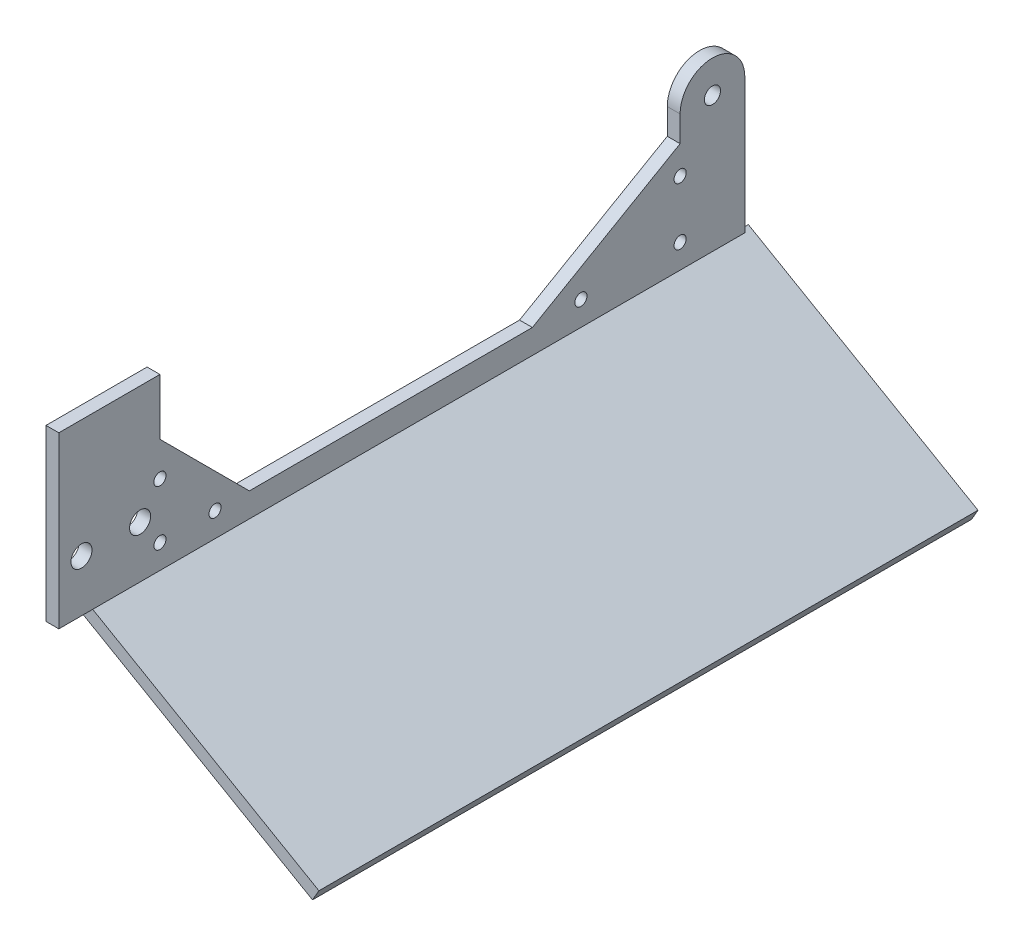
ISO-10303-21;
HEADER;
FILE_DESCRIPTION(('STEP AP214'),'2;1');
FILE_NAME('part.step','',(''),(''),'','','');
FILE_SCHEMA(('AUTOMOTIVE_DESIGN { 1 0 10303 214 1 1 1 1 }'));
ENDSEC;
DATA;
#1=APPLICATION_CONTEXT('core data for automotive mechanical design processes');
#2=APPLICATION_PROTOCOL_DEFINITION('international standard','automotive_design',2000,#1);
#3=PRODUCT_CONTEXT('',#1,'mechanical');
#4=PRODUCT('Part','Part','',(#3));
#5=PRODUCT_RELATED_PRODUCT_CATEGORY('part','',(#4));
#6=PRODUCT_DEFINITION_FORMATION('','',#4);
#7=PRODUCT_DEFINITION_CONTEXT('part definition',#1,'design');
#8=PRODUCT_DEFINITION('design','',#6,#7);
#9=PRODUCT_DEFINITION_SHAPE('','',#8);
#10=(LENGTH_UNIT() NAMED_UNIT(*) SI_UNIT(.MILLI.,.METRE.));
#11=(NAMED_UNIT(*) PLANE_ANGLE_UNIT() SI_UNIT($,.RADIAN.));
#12=(NAMED_UNIT(*) SI_UNIT($,.STERADIAN.) SOLID_ANGLE_UNIT());
#13=UNCERTAINTY_MEASURE_WITH_UNIT(LENGTH_MEASURE(1.E-05),#10,'distance_accuracy_value','');
#14=(GEOMETRIC_REPRESENTATION_CONTEXT(3) GLOBAL_UNCERTAINTY_ASSIGNED_CONTEXT((#13)) GLOBAL_UNIT_ASSIGNED_CONTEXT((#10,
#11,#12)) REPRESENTATION_CONTEXT('',''));
#15=CARTESIAN_POINT('',(0.,0.,0.));
#16=DIRECTION('',(0.,0.,1.));
#17=DIRECTION('',(1.,0.,0.));
#18=AXIS2_PLACEMENT_3D('',#15,#16,#17);
#19=CARTESIAN_POINT('',(3.175,36.4648077538263,-152.534918300919));
#20=DIRECTION('',(-1.,0.,0.));
#21=DIRECTION('',(0.,0.,1.));
#22=AXIS2_PLACEMENT_3D('',#19,#20,#21);
#23=PLANE('',#22);
#24=DIRECTION('',(0.,0.,1.));
#25=VECTOR('',#24,1.);
#26=CARTESIAN_POINT('',(3.175,8.99999999999999,-38.));
#27=LINE('',#26,#25);
#28=CARTESIAN_POINT('',(3.175,9.,-108.));
#29=VERTEX_POINT('',#28);
#30=CARTESIAN_POINT('',(3.175,8.99999999999999,-38.));
#31=VERTEX_POINT('',#30);
#32=EDGE_CURVE('E173',#29,#31,#27,.T.);
#33=ORIENTED_EDGE('',*,*,#32,.T.);
#34=DIRECTION('',(0.,0.707106781186549,0.707106781186546));
#35=VECTOR('',#34,1.);
#36=CARTESIAN_POINT('',(3.175,31.1150816990814,-15.8849183009187));
#37=LINE('',#36,#35);
#38=CARTESIAN_POINT('',(3.175,31.1150816990814,-15.8849183009187));
#39=VERTEX_POINT('',#38);
#40=EDGE_CURVE('E111',#31,#39,#37,.T.);
#41=ORIENTED_EDGE('',*,*,#40,.T.);
#42=DIRECTION('',(0.,1.,0.));
#43=VECTOR('',#42,1.);
#44=CARTESIAN_POINT('',(3.175,45.,-15.8849183009187));
#45=LINE('',#44,#43);
#46=CARTESIAN_POINT('',(3.175,45.,-15.8849183009187));
#47=VERTEX_POINT('',#46);
#48=EDGE_CURVE('E194',#39,#47,#45,.T.);
#49=ORIENTED_EDGE('',*,*,#48,.T.);
#50=DIRECTION('',(0.,0.,1.));
#51=VECTOR('',#50,1.);
#52=CARTESIAN_POINT('',(3.175,45.,9.11508169908136));
#53=LINE('',#52,#51);
#54=CARTESIAN_POINT('',(3.175,45.,9.11508169908136));
#55=VERTEX_POINT('',#54);
#56=EDGE_CURVE('E213',#47,#55,#53,.T.);
#57=ORIENTED_EDGE('',*,*,#56,.T.);
#58=DIRECTION('',(0.,-1.,0.));
#59=VECTOR('',#58,1.);
#60=CARTESIAN_POINT('',(3.175,45.,9.11508169908136));
#61=LINE('',#60,#59);
#62=CARTESIAN_POINT('',(3.175,2.99999999999999,9.11508169908136));
#63=VERTEX_POINT('',#62);
#64=EDGE_CURVE('E210',#55,#63,#61,.T.);
#65=ORIENTED_EDGE('',*,*,#64,.T.);
#66=DIRECTION('',(0.,0.,-1.));
#67=VECTOR('',#66,1.);
#68=CARTESIAN_POINT('',(3.175,2.99999999999999,9.11508169908136));
#69=LINE('',#68,#67);
#70=CARTESIAN_POINT('',(3.175,3.,-160.534918300919));
#71=VERTEX_POINT('',#70);
#72=EDGE_CURVE('E212',#63,#71,#69,.T.);
#73=ORIENTED_EDGE('',*,*,#72,.T.);
#74=DIRECTION('',(0.,1.,0.));
#75=VECTOR('',#74,1.);
#76=CARTESIAN_POINT('',(3.175,3.,-160.534918300919));
#77=LINE('',#76,#75);
#78=CARTESIAN_POINT('',(3.175,36.4648077538263,-160.534918300919));
#79=VERTEX_POINT('',#78);
#80=EDGE_CURVE('E136',#71,#79,#77,.T.);
#81=ORIENTED_EDGE('',*,*,#80,.T.);
#82=CARTESIAN_POINT('',(3.175,36.4648077538263,-152.534918300919));
#83=DIRECTION('',(1.,0.,0.));
#84=DIRECTION('',(0.,0.,1.));
#85=AXIS2_PLACEMENT_3D('',#82,#83,#84);
#86=CIRCLE('',#85,7.99999999999999);
#87=CARTESIAN_POINT('',(3.175,36.4648077538263,-144.534918300919));
#88=VERTEX_POINT('',#87);
#89=EDGE_CURVE('E130',#79,#88,#86,.T.);
#90=ORIENTED_EDGE('',*,*,#89,.T.);
#91=DIRECTION('',(0.,-1.,0.));
#92=VECTOR('',#91,1.);
#93=CARTESIAN_POINT('',(3.175,36.4648077538263,-144.534918300919));
#94=LINE('',#93,#92);
#95=CARTESIAN_POINT('',(3.175,30.0934449158564,-144.534918300919));
#96=VERTEX_POINT('',#95);
#97=EDGE_CURVE('E134',#88,#96,#94,.T.);
#98=ORIENTED_EDGE('',*,*,#97,.T.);
#99=DIRECTION('',(0.,-0.499999999999998,0.86602540378444));
#100=VECTOR('',#99,1.);
#101=CARTESIAN_POINT('',(3.175,30.0934449158564,-144.534918300919));
#102=LINE('',#101,#100);
#103=EDGE_CURVE('E62',#96,#29,#102,.T.);
#104=ORIENTED_EDGE('',*,*,#103,.T.);
#105=EDGE_LOOP('',(#33,#41,#49,#57,#65,#73,#81,#90,#98,#104));
#106=FACE_BOUND('',#105,.T.);
#107=CARTESIAN_POINT('',(3.175,36.4648077538263,-152.534918300919));
#108=DIRECTION('',(1.,0.,0.));
#109=DIRECTION('',(0.,0.,-1.));
#110=AXIS2_PLACEMENT_3D('',#107,#108,#109);
#111=CIRCLE('',#110,2.);
#112=CARTESIAN_POINT('',(3.175,36.4648077538263,-154.534918300919));
#113=VERTEX_POINT('',#112);
#114=EDGE_CURVE('E158',#113,#113,#111,.T.);
#115=ORIENTED_EDGE('',*,*,#114,.F.);
#116=EDGE_LOOP('',(#115));
#117=FACE_BOUND('',#116,.T.);
#118=CARTESIAN_POINT('',(3.175,15.814900162421,3.51508169908136));
#119=DIRECTION('',(1.,0.,0.));
#120=DIRECTION('',(0.,0.,-1.));
#121=AXIS2_PLACEMENT_3D('',#118,#119,#120);
#122=CIRCLE('',#121,2.6);
#123=CARTESIAN_POINT('',(3.175,15.814900162421,0.915081699081354));
#124=VERTEX_POINT('',#123);
#125=EDGE_CURVE('E224',#124,#124,#122,.T.);
#126=ORIENTED_EDGE('',*,*,#125,.F.);
#127=EDGE_LOOP('',(#126));
#128=FACE_BOUND('',#127,.T.);
#129=CARTESIAN_POINT('',(3.175,15.814900162421,-10.9849183009186));
#130=DIRECTION('',(1.,0.,0.));
#131=DIRECTION('',(0.,0.,-1.));
#132=AXIS2_PLACEMENT_3D('',#129,#130,#131);
#133=CIRCLE('',#132,2.6);
#134=CARTESIAN_POINT('',(3.175,15.814900162421,-13.5849183009186));
#135=VERTEX_POINT('',#134);
#136=EDGE_CURVE('E230',#135,#135,#133,.T.);
#137=ORIENTED_EDGE('',*,*,#136,.F.);
#138=EDGE_LOOP('',(#137));
#139=FACE_BOUND('',#138,.T.);
#140=CARTESIAN_POINT('',(3.175,22.6298003248428,-15.8849183009187));
#141=DIRECTION('',(1.,0.,0.));
#142=DIRECTION('',(0.,0.,-1.));
#143=AXIS2_PLACEMENT_3D('',#140,#141,#142);
#144=CIRCLE('',#143,1.50000000000008);
#145=CARTESIAN_POINT('',(3.175,22.6298003248428,-17.3849183009188));
#146=VERTEX_POINT('',#145);
#147=EDGE_CURVE('E236',#146,#146,#144,.T.);
#148=ORIENTED_EDGE('',*,*,#147,.F.);
#149=EDGE_LOOP('',(#148));
#150=FACE_BOUND('',#149,.T.);
#151=CARTESIAN_POINT('',(3.175,8.99999999999999,-120.));
#152=DIRECTION('',(1.,0.,0.));
#153=DIRECTION('',(0.,0.,-1.));
#154=AXIS2_PLACEMENT_3D('',#151,#152,#153);
#155=CIRCLE('',#154,1.49999999999996);
#156=CARTESIAN_POINT('',(3.175,8.99999999999999,-121.5));
#157=VERTEX_POINT('',#156);
#158=EDGE_CURVE('E242',#157,#157,#155,.T.);
#159=ORIENTED_EDGE('',*,*,#158,.F.);
#160=EDGE_LOOP('',(#159));
#161=FACE_BOUND('',#160,.T.);
#162=CARTESIAN_POINT('',(3.175,8.99999999999999,-29.5147186257614));
#163=DIRECTION('',(1.,0.,0.));
#164=DIRECTION('',(0.,0.,-1.));
#165=AXIS2_PLACEMENT_3D('',#162,#163,#164);
#166=CIRCLE('',#165,1.50000000000002);
#167=CARTESIAN_POINT('',(3.175,8.99999999999999,-31.0147186257615));
#168=VERTEX_POINT('',#167);
#169=EDGE_CURVE('E248',#168,#168,#166,.T.);
#170=ORIENTED_EDGE('',*,*,#169,.F.);
#171=EDGE_LOOP('',(#170));
#172=FACE_BOUND('',#171,.T.);
#173=CARTESIAN_POINT('',(3.175,23.1652416855809,-144.534918300919));
#174=DIRECTION('',(1.,0.,0.));
#175=DIRECTION('',(0.,0.,-1.));
#176=AXIS2_PLACEMENT_3D('',#173,#174,#175);
#177=CIRCLE('',#176,1.50000000000003);
#178=CARTESIAN_POINT('',(3.175,23.1652416855809,-146.034918300919));
#179=VERTEX_POINT('',#178);
#180=EDGE_CURVE('E254',#179,#179,#177,.T.);
#181=ORIENTED_EDGE('',*,*,#180,.F.);
#182=EDGE_LOOP('',(#181));
#183=FACE_BOUND('',#182,.T.);
#184=CARTESIAN_POINT('',(3.175,9.,-144.534918300919));
#185=DIRECTION('',(1.,0.,0.));
#186=DIRECTION('',(0.,0.,-1.));
#187=AXIS2_PLACEMENT_3D('',#184,#185,#186);
#188=CIRCLE('',#187,1.5);
#189=CARTESIAN_POINT('',(3.175,9.,-146.034918300919));
#190=VERTEX_POINT('',#189);
#191=EDGE_CURVE('E260',#190,#190,#188,.T.);
#192=ORIENTED_EDGE('',*,*,#191,.F.);
#193=EDGE_LOOP('',(#192));
#194=FACE_BOUND('',#193,.T.);
#195=CARTESIAN_POINT('',(3.175,8.99999999999999,-15.8849183009187));
#196=DIRECTION('',(1.,0.,0.));
#197=DIRECTION('',(0.,0.,-1.));
#198=AXIS2_PLACEMENT_3D('',#195,#196,#197);
#199=CIRCLE('',#198,1.5);
#200=CARTESIAN_POINT('',(3.175,8.99999999999999,-17.3849183009187));
#201=VERTEX_POINT('',#200);
#202=EDGE_CURVE('E266',#201,#201,#199,.T.);
#203=ORIENTED_EDGE('',*,*,#202,.F.);
#204=EDGE_LOOP('',(#203));
#205=FACE_BOUND('',#204,.T.);
#206=ADVANCED_FACE('F45',(#106,#117,#128,#139,#150,#161,#172,#183,#194,#205),#23,.F.);
#207=CARTESIAN_POINT('',(0.,36.4648077538263,-152.534918300919));
#208=DIRECTION('',(-1.,0.,0.));
#209=DIRECTION('',(0.,0.,1.));
#210=AXIS2_PLACEMENT_3D('',#207,#208,#209);
#211=PLANE('',#210);
#212=CARTESIAN_POINT('',(0.,9.,-144.534918300919));
#213=DIRECTION('',(1.,0.,0.));
#214=DIRECTION('',(0.,0.,-1.));
#215=AXIS2_PLACEMENT_3D('',#212,#213,#214);
#216=CIRCLE('',#215,1.5);
#217=CARTESIAN_POINT('',(0.,9.,-146.034918300919));
#218=VERTEX_POINT('',#217);
#219=EDGE_CURVE('E263',#218,#218,#216,.T.);
#220=ORIENTED_EDGE('',*,*,#219,.T.);
#221=EDGE_LOOP('',(#220));
#222=FACE_BOUND('',#221,.T.);
#223=CARTESIAN_POINT('',(0.,8.99999999999999,-29.5147186257614));
#224=DIRECTION('',(1.,0.,0.));
#225=DIRECTION('',(0.,0.,-1.));
#226=AXIS2_PLACEMENT_3D('',#223,#224,#225);
#227=CIRCLE('',#226,1.50000000000002);
#228=CARTESIAN_POINT('',(0.,8.99999999999999,-31.0147186257615));
#229=VERTEX_POINT('',#228);
#230=EDGE_CURVE('E251',#229,#229,#227,.T.);
#231=ORIENTED_EDGE('',*,*,#230,.T.);
#232=EDGE_LOOP('',(#231));
#233=FACE_BOUND('',#232,.T.);
#234=CARTESIAN_POINT('',(0.,22.6298003248428,-15.8849183009187));
#235=DIRECTION('',(1.,0.,0.));
#236=DIRECTION('',(0.,0.,-1.));
#237=AXIS2_PLACEMENT_3D('',#234,#235,#236);
#238=CIRCLE('',#237,1.50000000000008);
#239=CARTESIAN_POINT('',(0.,22.6298003248428,-17.3849183009188));
#240=VERTEX_POINT('',#239);
#241=EDGE_CURVE('E239',#240,#240,#238,.T.);
#242=ORIENTED_EDGE('',*,*,#241,.T.);
#243=EDGE_LOOP('',(#242));
#244=FACE_BOUND('',#243,.T.);
#245=CARTESIAN_POINT('',(0.,15.814900162421,3.51508169908136));
#246=DIRECTION('',(1.,0.,0.));
#247=DIRECTION('',(0.,0.,-1.));
#248=AXIS2_PLACEMENT_3D('',#245,#246,#247);
#249=CIRCLE('',#248,2.6);
#250=CARTESIAN_POINT('',(0.,15.814900162421,0.915081699081354));
#251=VERTEX_POINT('',#250);
#252=EDGE_CURVE('E227',#251,#251,#249,.T.);
#253=ORIENTED_EDGE('',*,*,#252,.T.);
#254=EDGE_LOOP('',(#253));
#255=FACE_BOUND('',#254,.T.);
#256=DIRECTION('',(0.,0.,1.));
#257=VECTOR('',#256,1.);
#258=CARTESIAN_POINT('',(0.,8.99999999999999,-38.));
#259=LINE('',#258,#257);
#260=CARTESIAN_POINT('',(0.,9.,-108.));
#261=VERTEX_POINT('',#260);
#262=CARTESIAN_POINT('',(0.,8.99999999999999,-38.));
#263=VERTEX_POINT('',#262);
#264=EDGE_CURVE('E154',#261,#263,#259,.T.);
#265=ORIENTED_EDGE('',*,*,#264,.F.);
#266=DIRECTION('',(0.,-0.499999999999998,0.86602540378444));
#267=VECTOR('',#266,1.);
#268=CARTESIAN_POINT('',(0.,30.0934449158564,-144.534918300919));
#269=LINE('',#268,#267);
#270=CARTESIAN_POINT('',(0.,30.0934449158564,-144.534918300919));
#271=VERTEX_POINT('',#270);
#272=EDGE_CURVE('E103',#271,#261,#269,.T.);
#273=ORIENTED_EDGE('',*,*,#272,.F.);
#274=DIRECTION('',(0.,-1.,0.));
#275=VECTOR('',#274,1.);
#276=CARTESIAN_POINT('',(0.,36.4648077538263,-144.534918300919));
#277=LINE('',#276,#275);
#278=CARTESIAN_POINT('',(0.,36.4648077538263,-144.534918300919));
#279=VERTEX_POINT('',#278);
#280=EDGE_CURVE('E97',#279,#271,#277,.T.);
#281=ORIENTED_EDGE('',*,*,#280,.F.);
#282=CARTESIAN_POINT('',(0.,36.4648077538263,-152.534918300919));
#283=DIRECTION('',(1.,0.,0.));
#284=DIRECTION('',(0.,0.,1.));
#285=AXIS2_PLACEMENT_3D('',#282,#283,#284);
#286=CIRCLE('',#285,7.99999999999999);
#287=CARTESIAN_POINT('',(0.,36.4648077538263,-160.534918300919));
#288=VERTEX_POINT('',#287);
#289=EDGE_CURVE('E144',#288,#279,#286,.T.);
#290=ORIENTED_EDGE('',*,*,#289,.F.);
#291=DIRECTION('',(0.,1.,0.));
#292=VECTOR('',#291,1.);
#293=CARTESIAN_POINT('',(0.,3.,-160.534918300919));
#294=LINE('',#293,#292);
#295=CARTESIAN_POINT('',(0.,3.,-160.534918300919));
#296=VERTEX_POINT('',#295);
#297=EDGE_CURVE('E168',#296,#288,#294,.T.);
#298=ORIENTED_EDGE('',*,*,#297,.F.);
#299=DIRECTION('',(0.,0.,-1.));
#300=VECTOR('',#299,1.);
#301=CARTESIAN_POINT('',(0.,2.99999999999999,9.11508169908136));
#302=LINE('',#301,#300);
#303=CARTESIAN_POINT('',(0.,2.99999999999999,9.11508169908136));
#304=VERTEX_POINT('',#303);
#305=EDGE_CURVE('E166',#304,#296,#302,.T.);
#306=ORIENTED_EDGE('',*,*,#305,.F.);
#307=DIRECTION('',(0.,-1.,0.));
#308=VECTOR('',#307,1.);
#309=CARTESIAN_POINT('',(0.,45.,9.11508169908136));
#310=LINE('',#309,#308);
#311=CARTESIAN_POINT('',(0.,45.,9.11508169908136));
#312=VERTEX_POINT('',#311);
#313=EDGE_CURVE('E164',#312,#304,#310,.T.);
#314=ORIENTED_EDGE('',*,*,#313,.F.);
#315=DIRECTION('',(0.,0.,1.));
#316=VECTOR('',#315,1.);
#317=CARTESIAN_POINT('',(0.,45.,9.11508169908136));
#318=LINE('',#317,#316);
#319=CARTESIAN_POINT('',(0.,45.,-15.8849183009187));
#320=VERTEX_POINT('',#319);
#321=EDGE_CURVE('E162',#320,#312,#318,.T.);
#322=ORIENTED_EDGE('',*,*,#321,.F.);
#323=DIRECTION('',(0.,1.,0.));
#324=VECTOR('',#323,1.);
#325=CARTESIAN_POINT('',(0.,45.,-15.8849183009187));
#326=LINE('',#325,#324);
#327=CARTESIAN_POINT('',(0.,31.1150816990814,-15.8849183009187));
#328=VERTEX_POINT('',#327);
#329=EDGE_CURVE('E160',#328,#320,#326,.T.);
#330=ORIENTED_EDGE('',*,*,#329,.F.);
#331=DIRECTION('',(0.,0.707106781186549,0.707106781186546));
#332=VECTOR('',#331,1.);
#333=CARTESIAN_POINT('',(0.,31.1150816990814,-15.8849183009187));
#334=LINE('',#333,#332);
#335=EDGE_CURVE('E157',#263,#328,#334,.T.);
#336=ORIENTED_EDGE('',*,*,#335,.F.);
#337=EDGE_LOOP('',(#265,#273,#281,#290,#298,#306,#314,#322,#330,#336));
#338=FACE_BOUND('',#337,.T.);
#339=CARTESIAN_POINT('',(0.,36.4648077538263,-152.534918300919));
#340=DIRECTION('',(1.,0.,0.));
#341=DIRECTION('',(0.,0.,-1.));
#342=AXIS2_PLACEMENT_3D('',#339,#340,#341);
#343=CIRCLE('',#342,2.);
#344=CARTESIAN_POINT('',(0.,36.4648077538263,-154.534918300919));
#345=VERTEX_POINT('',#344);
#346=EDGE_CURVE('E221',#345,#345,#343,.T.);
#347=ORIENTED_EDGE('',*,*,#346,.T.);
#348=EDGE_LOOP('',(#347));
#349=FACE_BOUND('',#348,.T.);
#350=CARTESIAN_POINT('',(0.,15.814900162421,-10.9849183009186));
#351=DIRECTION('',(1.,0.,0.));
#352=DIRECTION('',(0.,0.,-1.));
#353=AXIS2_PLACEMENT_3D('',#350,#351,#352);
#354=CIRCLE('',#353,2.6);
#355=CARTESIAN_POINT('',(0.,15.814900162421,-13.5849183009186));
#356=VERTEX_POINT('',#355);
#357=EDGE_CURVE('E233',#356,#356,#354,.T.);
#358=ORIENTED_EDGE('',*,*,#357,.T.);
#359=EDGE_LOOP('',(#358));
#360=FACE_BOUND('',#359,.T.);
#361=CARTESIAN_POINT('',(0.,8.99999999999999,-120.));
#362=DIRECTION('',(1.,0.,0.));
#363=DIRECTION('',(0.,0.,-1.));
#364=AXIS2_PLACEMENT_3D('',#361,#362,#363);
#365=CIRCLE('',#364,1.49999999999996);
#366=CARTESIAN_POINT('',(0.,8.99999999999999,-121.5));
#367=VERTEX_POINT('',#366);
#368=EDGE_CURVE('E245',#367,#367,#365,.T.);
#369=ORIENTED_EDGE('',*,*,#368,.T.);
#370=EDGE_LOOP('',(#369));
#371=FACE_BOUND('',#370,.T.);
#372=CARTESIAN_POINT('',(0.,23.1652416855809,-144.534918300919));
#373=DIRECTION('',(1.,0.,0.));
#374=DIRECTION('',(0.,0.,-1.));
#375=AXIS2_PLACEMENT_3D('',#372,#373,#374);
#376=CIRCLE('',#375,1.50000000000003);
#377=CARTESIAN_POINT('',(0.,23.1652416855809,-146.034918300919));
#378=VERTEX_POINT('',#377);
#379=EDGE_CURVE('E257',#378,#378,#376,.T.);
#380=ORIENTED_EDGE('',*,*,#379,.T.);
#381=EDGE_LOOP('',(#380));
#382=FACE_BOUND('',#381,.T.);
#383=CARTESIAN_POINT('',(0.,8.99999999999999,-15.8849183009187));
#384=DIRECTION('',(1.,0.,0.));
#385=DIRECTION('',(0.,0.,-1.));
#386=AXIS2_PLACEMENT_3D('',#383,#384,#385);
#387=CIRCLE('',#386,1.5);
#388=CARTESIAN_POINT('',(0.,8.99999999999999,-17.3849183009187));
#389=VERTEX_POINT('',#388);
#390=EDGE_CURVE('E269',#389,#389,#387,.T.);
#391=ORIENTED_EDGE('',*,*,#390,.T.);
#392=EDGE_LOOP('',(#391));
#393=FACE_BOUND('',#392,.T.);
#394=ADVANCED_FACE('F198',(#222,#233,#244,#255,#338,#349,#360,#371,#382,#393),#211,.T.);
#395=CARTESIAN_POINT('',(3.175,8.99999999999999,-38.));
#396=DIRECTION('',(0.,-1.,0.));
#397=DIRECTION('',(0.,0.,-1.));
#398=AXIS2_PLACEMENT_3D('',#395,#396,#397);
#399=PLANE('',#398);
#400=ORIENTED_EDGE('',*,*,#264,.T.);
#401=DIRECTION('',(-1.,0.,0.));
#402=VECTOR('',#401,1.);
#403=CARTESIAN_POINT('',(3.175,8.99999999999999,-38.));
#404=LINE('',#403,#402);
#405=EDGE_CURVE('E12',#31,#263,#404,.T.);
#406=ORIENTED_EDGE('',*,*,#405,.F.);
#407=ORIENTED_EDGE('',*,*,#32,.F.);
#408=DIRECTION('',(-1.,0.,0.));
#409=VECTOR('',#408,1.);
#410=CARTESIAN_POINT('',(3.175,9.,-108.));
#411=LINE('',#410,#409);
#412=EDGE_CURVE('E150',#29,#261,#411,.T.);
#413=ORIENTED_EDGE('',*,*,#412,.T.);
#414=EDGE_LOOP('',(#400,#406,#407,#413));
#415=FACE_BOUND('',#414,.T.);
#416=ADVANCED_FACE('F47',(#415),#399,.F.);
#417=CARTESIAN_POINT('',(3.175,31.1150816990814,-15.8849183009187));
#418=DIRECTION('',(0.,-0.707106781186546,0.707106781186549));
#419=DIRECTION('',(0.,-0.707106781186549,-0.707106781186546));
#420=AXIS2_PLACEMENT_3D('',#417,#418,#419);
#421=PLANE('',#420);
#422=ORIENTED_EDGE('',*,*,#335,.T.);
#423=DIRECTION('',(-1.,0.,0.));
#424=VECTOR('',#423,1.);
#425=CARTESIAN_POINT('',(3.175,31.1150816990814,-15.8849183009187));
#426=LINE('',#425,#424);
#427=EDGE_CURVE('E54',#39,#328,#426,.T.);
#428=ORIENTED_EDGE('',*,*,#427,.F.);
#429=ORIENTED_EDGE('',*,*,#40,.F.);
#430=ORIENTED_EDGE('',*,*,#405,.T.);
#431=EDGE_LOOP('',(#422,#428,#429,#430));
#432=FACE_BOUND('',#431,.T.);
#433=ADVANCED_FACE('F309',(#432),#421,.F.);
#434=CARTESIAN_POINT('',(3.175,45.,-15.8849183009187));
#435=DIRECTION('',(0.,0.,1.));
#436=DIRECTION('',(1.,0.,0.));
#437=AXIS2_PLACEMENT_3D('',#434,#435,#436);
#438=PLANE('',#437);
#439=ORIENTED_EDGE('',*,*,#329,.T.);
#440=DIRECTION('',(-1.,0.,0.));
#441=VECTOR('',#440,1.);
#442=CARTESIAN_POINT('',(3.175,45.,-15.8849183009187));
#443=LINE('',#442,#441);
#444=EDGE_CURVE('E186',#47,#320,#443,.T.);
#445=ORIENTED_EDGE('',*,*,#444,.F.);
#446=ORIENTED_EDGE('',*,*,#48,.F.);
#447=ORIENTED_EDGE('',*,*,#427,.T.);
#448=EDGE_LOOP('',(#439,#445,#446,#447));
#449=FACE_BOUND('',#448,.T.);
#450=ADVANCED_FACE('F192',(#449),#438,.F.);
#451=CARTESIAN_POINT('',(3.175,45.,9.11508169908136));
#452=DIRECTION('',(0.,-1.,0.));
#453=DIRECTION('',(0.,0.,-1.));
#454=AXIS2_PLACEMENT_3D('',#451,#452,#453);
#455=PLANE('',#454);
#456=ORIENTED_EDGE('',*,*,#321,.T.);
#457=DIRECTION('',(-1.,0.,0.));
#458=VECTOR('',#457,1.);
#459=CARTESIAN_POINT('',(3.175,45.,9.11508169908136));
#460=LINE('',#459,#458);
#461=EDGE_CURVE('E183',#55,#312,#460,.T.);
#462=ORIENTED_EDGE('',*,*,#461,.F.);
#463=ORIENTED_EDGE('',*,*,#56,.F.);
#464=ORIENTED_EDGE('',*,*,#444,.T.);
#465=EDGE_LOOP('',(#456,#462,#463,#464));
#466=FACE_BOUND('',#465,.T.);
#467=ADVANCED_FACE('F204',(#466),#455,.F.);
#468=CARTESIAN_POINT('',(3.175,45.,9.11508169908136));
#469=DIRECTION('',(0.,0.,-1.));
#470=DIRECTION('',(-1.,0.,0.));
#471=AXIS2_PLACEMENT_3D('',#468,#469,#470);
#472=PLANE('',#471);
#473=ORIENTED_EDGE('',*,*,#313,.T.);
#474=DIRECTION('',(-1.,0.,0.));
#475=VECTOR('',#474,1.);
#476=CARTESIAN_POINT('',(3.175,2.99999999999999,9.11508169908136));
#477=LINE('',#476,#475);
#478=EDGE_CURVE('E180',#63,#304,#477,.T.);
#479=ORIENTED_EDGE('',*,*,#478,.F.);
#480=ORIENTED_EDGE('',*,*,#64,.F.);
#481=ORIENTED_EDGE('',*,*,#461,.T.);
#482=EDGE_LOOP('',(#473,#479,#480,#481));
#483=FACE_BOUND('',#482,.T.);
#484=ADVANCED_FACE('F208',(#483),#472,.F.);
#485=CARTESIAN_POINT('',(3.175,2.99999999999999,9.11508169908136));
#486=DIRECTION('',(0.,1.,0.));
#487=DIRECTION('',(0.,0.,1.));
#488=AXIS2_PLACEMENT_3D('',#485,#486,#487);
#489=PLANE('',#488);
#490=ORIENTED_EDGE('',*,*,#305,.T.);
#491=DIRECTION('',(-1.,0.,0.));
#492=VECTOR('',#491,1.);
#493=CARTESIAN_POINT('',(3.175,3.,-160.534918300919));
#494=LINE('',#493,#492);
#495=EDGE_CURVE('E177',#71,#296,#494,.T.);
#496=ORIENTED_EDGE('',*,*,#495,.F.);
#497=ORIENTED_EDGE('',*,*,#72,.F.);
#498=ORIENTED_EDGE('',*,*,#478,.T.);
#499=EDGE_LOOP('',(#490,#496,#497,#498));
#500=FACE_BOUND('',#499,.T.);
#501=ADVANCED_FACE('F299',(#500),#489,.F.);
#502=CARTESIAN_POINT('',(3.175,3.,-160.534918300919));
#503=DIRECTION('',(0.,0.,1.));
#504=DIRECTION('',(1.,0.,0.));
#505=AXIS2_PLACEMENT_3D('',#502,#503,#504);
#506=PLANE('',#505);
#507=ORIENTED_EDGE('',*,*,#297,.T.);
#508=DIRECTION('',(-1.,0.,0.));
#509=VECTOR('',#508,1.);
#510=CARTESIAN_POINT('',(3.175,36.4648077538263,-160.534918300919));
#511=LINE('',#510,#509);
#512=EDGE_CURVE('E145',#79,#288,#511,.T.);
#513=ORIENTED_EDGE('',*,*,#512,.F.);
#514=ORIENTED_EDGE('',*,*,#80,.F.);
#515=ORIENTED_EDGE('',*,*,#495,.T.);
#516=EDGE_LOOP('',(#507,#513,#514,#515));
#517=FACE_BOUND('',#516,.T.);
#518=ADVANCED_FACE('F296',(#517),#506,.F.);
#519=CARTESIAN_POINT('',(3.175,36.4648077538263,-152.534918300919));
#520=DIRECTION('',(-1.,0.,0.));
#521=DIRECTION('',(0.,0.,1.));
#522=AXIS2_PLACEMENT_3D('',#519,#520,#521);
#523=CYLINDRICAL_SURFACE('',#522,7.99999999999999);
#524=ORIENTED_EDGE('',*,*,#289,.T.);
#525=DIRECTION('',(-1.,0.,0.));
#526=VECTOR('',#525,1.);
#527=CARTESIAN_POINT('',(3.175,36.4648077538263,-144.534918300919));
#528=LINE('',#527,#526);
#529=EDGE_CURVE('E141',#88,#279,#528,.T.);
#530=ORIENTED_EDGE('',*,*,#529,.F.);
#531=ORIENTED_EDGE('',*,*,#89,.F.);
#532=ORIENTED_EDGE('',*,*,#512,.T.);
#533=EDGE_LOOP('',(#524,#530,#531,#532));
#534=FACE_BOUND('',#533,.T.);
#535=ADVANCED_FACE('F142',(#534),#523,.T.);
#536=CARTESIAN_POINT('',(3.175,36.4648077538263,-144.534918300919));
#537=DIRECTION('',(0.,0.,-1.));
#538=DIRECTION('',(-1.,0.,0.));
#539=AXIS2_PLACEMENT_3D('',#536,#537,#538);
#540=PLANE('',#539);
#541=ORIENTED_EDGE('',*,*,#280,.T.);
#542=DIRECTION('',(-1.,0.,0.));
#543=VECTOR('',#542,1.);
#544=CARTESIAN_POINT('',(3.175,30.0934449158564,-144.534918300919));
#545=LINE('',#544,#543);
#546=EDGE_CURVE('E146',#96,#271,#545,.T.);
#547=ORIENTED_EDGE('',*,*,#546,.F.);
#548=ORIENTED_EDGE('',*,*,#97,.F.);
#549=ORIENTED_EDGE('',*,*,#529,.T.);
#550=EDGE_LOOP('',(#541,#547,#548,#549));
#551=FACE_BOUND('',#550,.T.);
#552=ADVANCED_FACE('F148',(#551),#540,.F.);
#553=CARTESIAN_POINT('',(3.175,30.0934449158564,-144.534918300919));
#554=DIRECTION('',(0.,-0.86602540378444,-0.499999999999998));
#555=DIRECTION('',(0.,0.499999999999998,-0.86602540378444));
#556=AXIS2_PLACEMENT_3D('',#553,#554,#555);
#557=PLANE('',#556);
#558=ORIENTED_EDGE('',*,*,#272,.T.);
#559=ORIENTED_EDGE('',*,*,#412,.F.);
#560=ORIENTED_EDGE('',*,*,#103,.F.);
#561=ORIENTED_EDGE('',*,*,#546,.T.);
#562=EDGE_LOOP('',(#558,#559,#560,#561));
#563=FACE_BOUND('',#562,.T.);
#564=ADVANCED_FACE('F289',(#563),#557,.F.);
#565=CARTESIAN_POINT('',(3.175,36.4648077538263,-152.534918300919));
#566=DIRECTION('',(-1.,0.,0.));
#567=DIRECTION('',(0.,0.,1.));
#568=AXIS2_PLACEMENT_3D('',#565,#566,#567);
#569=CYLINDRICAL_SURFACE('',#568,2.);
#570=ORIENTED_EDGE('',*,*,#114,.T.);
#571=EDGE_LOOP('',(#570));
#572=FACE_BOUND('',#571,.T.);
#573=ORIENTED_EDGE('',*,*,#346,.F.);
#574=EDGE_LOOP('',(#573));
#575=FACE_BOUND('',#574,.T.);
#576=ADVANCED_FACE('F286',(#572,#575),#569,.F.);
#577=CARTESIAN_POINT('',(3.175,15.814900162421,3.51508169908136));
#578=DIRECTION('',(-1.,0.,0.));
#579=DIRECTION('',(0.,0.,1.));
#580=AXIS2_PLACEMENT_3D('',#577,#578,#579);
#581=CYLINDRICAL_SURFACE('',#580,2.6);
#582=ORIENTED_EDGE('',*,*,#125,.T.);
#583=EDGE_LOOP('',(#582));
#584=FACE_BOUND('',#583,.T.);
#585=ORIENTED_EDGE('',*,*,#252,.F.);
#586=EDGE_LOOP('',(#585));
#587=FACE_BOUND('',#586,.T.);
#588=ADVANCED_FACE('F385',(#584,#587),#581,.F.);
#589=CARTESIAN_POINT('',(3.175,15.814900162421,-10.9849183009186));
#590=DIRECTION('',(-1.,0.,0.));
#591=DIRECTION('',(0.,0.,1.));
#592=AXIS2_PLACEMENT_3D('',#589,#590,#591);
#593=CYLINDRICAL_SURFACE('',#592,2.6);
#594=ORIENTED_EDGE('',*,*,#136,.T.);
#595=EDGE_LOOP('',(#594));
#596=FACE_BOUND('',#595,.T.);
#597=ORIENTED_EDGE('',*,*,#357,.F.);
#598=EDGE_LOOP('',(#597));
#599=FACE_BOUND('',#598,.T.);
#600=ADVANCED_FACE('F393',(#596,#599),#593,.F.);
#601=CARTESIAN_POINT('',(3.175,22.6298003248428,-15.8849183009187));
#602=DIRECTION('',(-1.,0.,0.));
#603=DIRECTION('',(0.,0.,1.));
#604=AXIS2_PLACEMENT_3D('',#601,#602,#603);
#605=CYLINDRICAL_SURFACE('',#604,1.50000000000008);
#606=ORIENTED_EDGE('',*,*,#147,.T.);
#607=EDGE_LOOP('',(#606));
#608=FACE_BOUND('',#607,.T.);
#609=ORIENTED_EDGE('',*,*,#241,.F.);
#610=EDGE_LOOP('',(#609));
#611=FACE_BOUND('',#610,.T.);
#612=ADVANCED_FACE('F401',(#608,#611),#605,.F.);
#613=CARTESIAN_POINT('',(3.175,8.99999999999999,-120.));
#614=DIRECTION('',(-1.,0.,0.));
#615=DIRECTION('',(0.,0.,1.));
#616=AXIS2_PLACEMENT_3D('',#613,#614,#615);
#617=CYLINDRICAL_SURFACE('',#616,1.49999999999996);
#618=ORIENTED_EDGE('',*,*,#158,.T.);
#619=EDGE_LOOP('',(#618));
#620=FACE_BOUND('',#619,.T.);
#621=ORIENTED_EDGE('',*,*,#368,.F.);
#622=EDGE_LOOP('',(#621));
#623=FACE_BOUND('',#622,.T.);
#624=ADVANCED_FACE('F410',(#620,#623),#617,.F.);
#625=CARTESIAN_POINT('',(3.175,8.99999999999999,-29.5147186257614));
#626=DIRECTION('',(-1.,0.,0.));
#627=DIRECTION('',(0.,0.,1.));
#628=AXIS2_PLACEMENT_3D('',#625,#626,#627);
#629=CYLINDRICAL_SURFACE('',#628,1.50000000000002);
#630=ORIENTED_EDGE('',*,*,#169,.T.);
#631=EDGE_LOOP('',(#630));
#632=FACE_BOUND('',#631,.T.);
#633=ORIENTED_EDGE('',*,*,#230,.F.);
#634=EDGE_LOOP('',(#633));
#635=FACE_BOUND('',#634,.T.);
#636=ADVANCED_FACE('F419',(#632,#635),#629,.F.);
#637=CARTESIAN_POINT('',(3.175,23.1652416855809,-144.534918300919));
#638=DIRECTION('',(-1.,0.,0.));
#639=DIRECTION('',(0.,0.,1.));
#640=AXIS2_PLACEMENT_3D('',#637,#638,#639);
#641=CYLINDRICAL_SURFACE('',#640,1.50000000000003);
#642=ORIENTED_EDGE('',*,*,#180,.T.);
#643=EDGE_LOOP('',(#642));
#644=FACE_BOUND('',#643,.T.);
#645=ORIENTED_EDGE('',*,*,#379,.F.);
#646=EDGE_LOOP('',(#645));
#647=FACE_BOUND('',#646,.T.);
#648=ADVANCED_FACE('F428',(#644,#647),#641,.F.);
#649=CARTESIAN_POINT('',(3.175,9.,-144.534918300919));
#650=DIRECTION('',(-1.,0.,0.));
#651=DIRECTION('',(0.,0.,1.));
#652=AXIS2_PLACEMENT_3D('',#649,#650,#651);
#653=CYLINDRICAL_SURFACE('',#652,1.5);
#654=ORIENTED_EDGE('',*,*,#191,.T.);
#655=EDGE_LOOP('',(#654));
#656=FACE_BOUND('',#655,.T.);
#657=ORIENTED_EDGE('',*,*,#219,.F.);
#658=EDGE_LOOP('',(#657));
#659=FACE_BOUND('',#658,.T.);
#660=ADVANCED_FACE('F437',(#656,#659),#653,.F.);
#661=CARTESIAN_POINT('',(3.175,8.99999999999999,-15.8849183009187));
#662=DIRECTION('',(-1.,0.,0.));
#663=DIRECTION('',(0.,0.,1.));
#664=AXIS2_PLACEMENT_3D('',#661,#662,#663);
#665=CYLINDRICAL_SURFACE('',#664,1.5);
#666=ORIENTED_EDGE('',*,*,#202,.T.);
#667=EDGE_LOOP('',(#666));
#668=FACE_BOUND('',#667,.T.);
#669=ORIENTED_EDGE('',*,*,#390,.F.);
#670=EDGE_LOOP('',(#669));
#671=FACE_BOUND('',#670,.T.);
#672=ADVANCED_FACE('F275',(#668,#671),#665,.F.);
#673=CLOSED_SHELL('',(#206,#394,#416,#433,#450,#467,#484,#501,#518,#535,#552,#564,#576,#588,
#600,#612,#624,#636,#648,#660,#672));
#674=MANIFOLD_SOLID_BREP('B2',#673);
#675=CARTESIAN_POINT('',(1.58750000000001,2.74963065701559,-163.));
#676=DIRECTION('',(0.,0.,-1.));
#677=DIRECTION('',(-1.,0.,0.));
#678=AXIS2_PLACEMENT_3D('',#675,#676,#677);
#679=PLANE('',#678);
#680=DIRECTION('',(0.866025403784436,-0.500000000000004,0.));
#681=VECTOR('',#680,1.);
#682=CARTESIAN_POINT('',(0.,0.,-163.));
#683=LINE('',#682,#681);
#684=CARTESIAN_POINT('',(0.,0.,-163.));
#685=VERTEX_POINT('',#684);
#686=CARTESIAN_POINT('',(56.7946532917996,-32.7904083665523,-163.));
#687=VERTEX_POINT('',#686);
#688=EDGE_CURVE('E578',#685,#687,#683,.T.);
#689=ORIENTED_EDGE('',*,*,#688,.F.);
#690=DIRECTION('',(-0.500000000000004,-0.866025403784436,0.));
#691=VECTOR('',#690,1.);
#692=CARTESIAN_POINT('',(1.58750000000001,2.74963065701559,-163.));
#693=LINE('',#692,#691);
#694=CARTESIAN_POINT('',(1.58750000000001,2.74963065701559,-163.));
#695=VERTEX_POINT('',#694);
#696=EDGE_CURVE('E43',#695,#685,#693,.T.);
#697=ORIENTED_EDGE('',*,*,#696,.F.);
#698=DIRECTION('',(0.866025403784436,-0.500000000000004,0.));
#699=VECTOR('',#698,1.);
#700=CARTESIAN_POINT('',(1.58750000000001,2.74963065701559,-163.));
#701=LINE('',#700,#699);
#702=CARTESIAN_POINT('',(58.3821532917997,-30.0407777095368,-163.));
#703=VERTEX_POINT('',#702);
#704=EDGE_CURVE('E572',#695,#703,#701,.T.);
#705=ORIENTED_EDGE('',*,*,#704,.T.);
#706=DIRECTION('',(-0.500000000000004,-0.866025403784436,0.));
#707=VECTOR('',#706,1.);
#708=CARTESIAN_POINT('',(58.3821532917997,-30.0407777095368,-163.));
#709=LINE('',#708,#707);
#710=EDGE_CURVE('E517',#703,#687,#709,.T.);
#711=ORIENTED_EDGE('',*,*,#710,.T.);
#712=EDGE_LOOP('',(#689,#697,#705,#711));
#713=FACE_BOUND('',#712,.T.);
#714=ADVANCED_FACE('F514',(#713),#679,.T.);
#715=CARTESIAN_POINT('',(1.58750000000001,2.74963065701559,-163.));
#716=DIRECTION('',(-0.866025403784436,0.500000000000004,0.));
#717=DIRECTION('',(-0.500000000000004,-0.866025403784436,0.));
#718=AXIS2_PLACEMENT_3D('',#715,#716,#717);
#719=PLANE('',#718);
#720=DIRECTION('',(0.,0.,-1.));
#721=VECTOR('',#720,1.);
#722=CARTESIAN_POINT('',(0.,0.,-163.));
#723=LINE('',#722,#721);
#724=CARTESIAN_POINT('',(0.,0.,0.));
#725=VERTEX_POINT('',#724);
#726=EDGE_CURVE('E574',#725,#685,#723,.T.);
#727=ORIENTED_EDGE('',*,*,#726,.F.);
#728=DIRECTION('',(-0.500000000000004,-0.866025403784436,0.));
#729=VECTOR('',#728,1.);
#730=CARTESIAN_POINT('',(1.58750000000001,2.74963065701559,0.));
#731=LINE('',#730,#729);
#732=CARTESIAN_POINT('',(1.58750000000001,2.74963065701559,0.));
#733=VERTEX_POINT('',#732);
#734=EDGE_CURVE('E523',#733,#725,#731,.T.);
#735=ORIENTED_EDGE('',*,*,#734,.F.);
#736=DIRECTION('',(0.,0.,-1.));
#737=VECTOR('',#736,1.);
#738=CARTESIAN_POINT('',(1.58750000000001,2.74963065701559,-163.));
#739=LINE('',#738,#737);
#740=EDGE_CURVE('E569',#733,#695,#739,.T.);
#741=ORIENTED_EDGE('',*,*,#740,.T.);
#742=ORIENTED_EDGE('',*,*,#696,.T.);
#743=EDGE_LOOP('',(#727,#735,#741,#742));
#744=FACE_BOUND('',#743,.T.);
#745=ADVANCED_FACE('F588',(#744),#719,.T.);
#746=CARTESIAN_POINT('',(1.58750000000001,2.74963065701559,0.));
#747=DIRECTION('',(0.,0.,1.));
#748=DIRECTION('',(1.,0.,0.));
#749=AXIS2_PLACEMENT_3D('',#746,#747,#748);
#750=PLANE('',#749);
#751=DIRECTION('',(-0.866025403784436,0.500000000000004,0.));
#752=VECTOR('',#751,1.);
#753=CARTESIAN_POINT('',(0.,0.,0.));
#754=LINE('',#753,#752);
#755=CARTESIAN_POINT('',(56.7946532917996,-32.7904083665523,0.));
#756=VERTEX_POINT('',#755);
#757=EDGE_CURVE('E564',#756,#725,#754,.T.);
#758=ORIENTED_EDGE('',*,*,#757,.F.);
#759=DIRECTION('',(-0.500000000000004,-0.866025403784436,0.));
#760=VECTOR('',#759,1.);
#761=CARTESIAN_POINT('',(58.3821532917996,-30.0407777095368,0.));
#762=LINE('',#761,#760);
#763=CARTESIAN_POINT('',(58.3821532917996,-30.0407777095368,0.));
#764=VERTEX_POINT('',#763);
#765=EDGE_CURVE('E559',#764,#756,#762,.T.);
#766=ORIENTED_EDGE('',*,*,#765,.F.);
#767=DIRECTION('',(-0.866025403784436,0.500000000000004,0.));
#768=VECTOR('',#767,1.);
#769=CARTESIAN_POINT('',(1.58750000000001,2.74963065701559,0.));
#770=LINE('',#769,#768);
#771=EDGE_CURVE('E562',#764,#733,#770,.T.);
#772=ORIENTED_EDGE('',*,*,#771,.T.);
#773=ORIENTED_EDGE('',*,*,#734,.T.);
#774=EDGE_LOOP('',(#758,#766,#772,#773));
#775=FACE_BOUND('',#774,.T.);
#776=ADVANCED_FACE('F561',(#775),#750,.T.);
#777=CARTESIAN_POINT('',(58.3821532917997,-30.0407777095368,-163.));
#778=DIRECTION('',(0.866025403784436,-0.500000000000004,0.));
#779=DIRECTION('',(0.500000000000004,0.866025403784436,0.));
#780=AXIS2_PLACEMENT_3D('',#777,#778,#779);
#781=PLANE('',#780);
#782=DIRECTION('',(0.,0.,1.));
#783=VECTOR('',#782,1.);
#784=CARTESIAN_POINT('',(56.7946532917996,-32.7904083665523,-163.));
#785=LINE('',#784,#783);
#786=EDGE_CURVE('E581',#687,#756,#785,.T.);
#787=ORIENTED_EDGE('',*,*,#786,.F.);
#788=ORIENTED_EDGE('',*,*,#710,.F.);
#789=DIRECTION('',(0.,0.,1.));
#790=VECTOR('',#789,1.);
#791=CARTESIAN_POINT('',(58.3821532917997,-30.0407777095368,-163.));
#792=LINE('',#791,#790);
#793=EDGE_CURVE('E568',#703,#764,#792,.T.);
#794=ORIENTED_EDGE('',*,*,#793,.T.);
#795=ORIENTED_EDGE('',*,*,#765,.T.);
#796=EDGE_LOOP('',(#787,#788,#794,#795));
#797=FACE_BOUND('',#796,.T.);
#798=ADVANCED_FACE('F571',(#797),#781,.T.);
#799=CARTESIAN_POINT('',(1.58750000000001,2.74963065701558,0.));
#800=DIRECTION('',(-0.500000000000004,-0.866025403784436,0.));
#801=DIRECTION('',(0.866025403784436,-0.500000000000004,0.));
#802=AXIS2_PLACEMENT_3D('',#799,#800,#801);
#803=PLANE('',#802);
#804=ORIENTED_EDGE('',*,*,#704,.F.);
#805=ORIENTED_EDGE('',*,*,#740,.F.);
#806=ORIENTED_EDGE('',*,*,#771,.F.);
#807=ORIENTED_EDGE('',*,*,#793,.F.);
#808=EDGE_LOOP('',(#804,#805,#806,#807));
#809=FACE_BOUND('',#808,.T.);
#810=ADVANCED_FACE('F567',(#809),#803,.F.);
#811=CARTESIAN_POINT('',(0.,0.,0.));
#812=DIRECTION('',(-0.500000000000004,-0.866025403784436,0.));
#813=DIRECTION('',(0.866025403784436,-0.500000000000004,0.));
#814=AXIS2_PLACEMENT_3D('',#811,#812,#813);
#815=PLANE('',#814);
#816=ORIENTED_EDGE('',*,*,#688,.T.);
#817=ORIENTED_EDGE('',*,*,#786,.T.);
#818=ORIENTED_EDGE('',*,*,#757,.T.);
#819=ORIENTED_EDGE('',*,*,#726,.T.);
#820=EDGE_LOOP('',(#816,#817,#818,#819));
#821=FACE_BOUND('',#820,.T.);
#822=ADVANCED_FACE('F587',(#821),#815,.T.);
#823=CLOSED_SHELL('',(#714,#745,#776,#798,#810,#822));
#824=MANIFOLD_SOLID_BREP('B6_NOT_SHOWN',#823);
#825=ADVANCED_BREP_SHAPE_REPRESENTATION('',(#18,#674,#824),#14);
#826=SHAPE_DEFINITION_REPRESENTATION(#9,#825);
ENDSEC;
END-ISO-10303-21;
